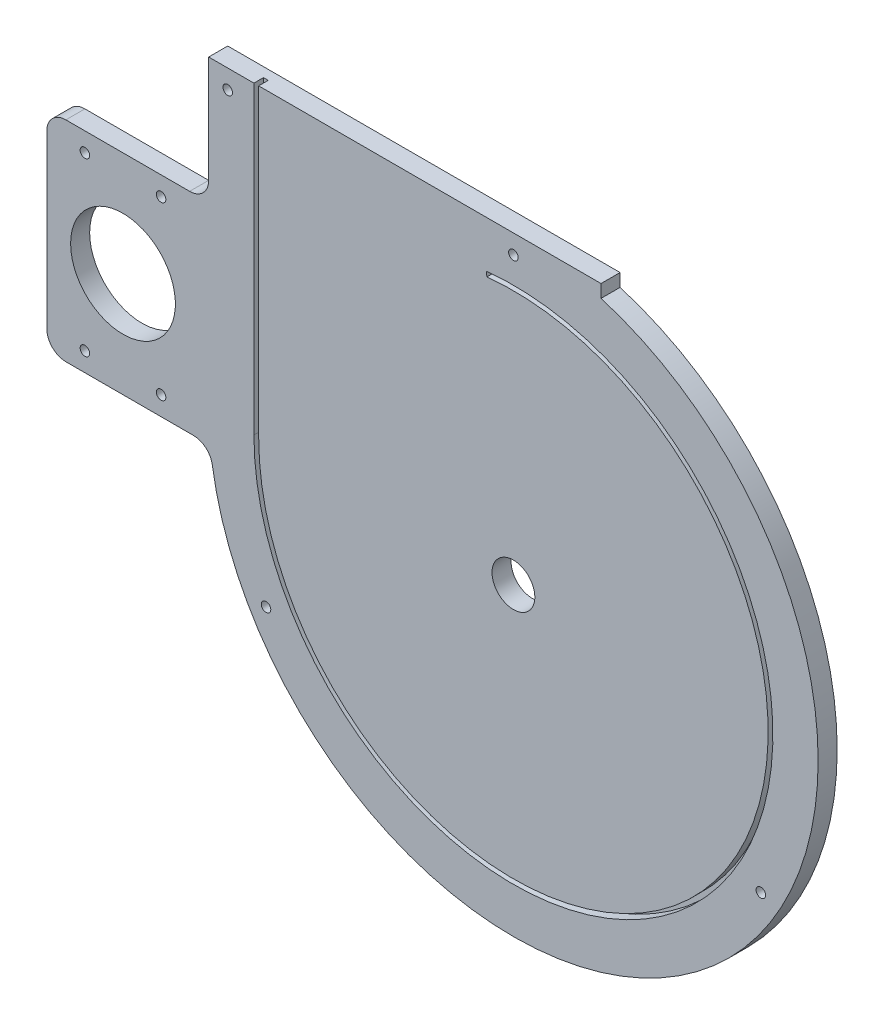
ISO-10303-21;
HEADER;
FILE_DESCRIPTION(('STEP AP214'),'2;1');
FILE_NAME('part.step','',(''),(''),'','','');
FILE_SCHEMA(('AUTOMOTIVE_DESIGN { 1 0 10303 214 1 1 1 1 }'));
ENDSEC;
DATA;
#1=APPLICATION_CONTEXT('core data for automotive mechanical design processes');
#2=APPLICATION_PROTOCOL_DEFINITION('international standard','automotive_design',2000,#1);
#3=PRODUCT_CONTEXT('',#1,'mechanical');
#4=PRODUCT('Part','Part','',(#3));
#5=PRODUCT_RELATED_PRODUCT_CATEGORY('part','',(#4));
#6=PRODUCT_DEFINITION_FORMATION('','',#4);
#7=PRODUCT_DEFINITION_CONTEXT('part definition',#1,'design');
#8=PRODUCT_DEFINITION('design','',#6,#7);
#9=PRODUCT_DEFINITION_SHAPE('','',#8);
#10=(LENGTH_UNIT() NAMED_UNIT(*) SI_UNIT(.MILLI.,.METRE.));
#11=(NAMED_UNIT(*) PLANE_ANGLE_UNIT() SI_UNIT($,.RADIAN.));
#12=(NAMED_UNIT(*) SI_UNIT($,.STERADIAN.) SOLID_ANGLE_UNIT());
#13=UNCERTAINTY_MEASURE_WITH_UNIT(LENGTH_MEASURE(1.E-05),#10,'distance_accuracy_value','');
#14=(GEOMETRIC_REPRESENTATION_CONTEXT(3) GLOBAL_UNCERTAINTY_ASSIGNED_CONTEXT((#13)) GLOBAL_UNIT_ASSIGNED_CONTEXT((#10,
#11,#12)) REPRESENTATION_CONTEXT('',''));
#15=CARTESIAN_POINT('',(0.,0.,0.));
#16=DIRECTION('',(0.,0.,1.));
#17=DIRECTION('',(1.,0.,0.));
#18=AXIS2_PLACEMENT_3D('',#15,#16,#17);
#19=CARTESIAN_POINT('',(0.,0.,12.7));
#20=DIRECTION('',(0.,0.,1.));
#21=DIRECTION('',(1.,0.,0.));
#22=AXIS2_PLACEMENT_3D('',#19,#20,#21);
#23=PLANE('',#22);
#24=DIRECTION('',(0.,1.,0.));
#25=VECTOR('',#24,1.);
#26=CARTESIAN_POINT('',(-311.15,119.275474201064,12.7));
#27=LINE('',#26,#25);
#28=CARTESIAN_POINT('',(-311.15,-7.72452579893591,12.7));
#29=VERTEX_POINT('',#28);
#30=CARTESIAN_POINT('',(-311.15,106.575474201064,12.7));
#31=VERTEX_POINT('',#30);
#32=EDGE_CURVE('E383',#29,#31,#27,.T.);
#33=ORIENTED_EDGE('',*,*,#32,.F.);
#34=CARTESIAN_POINT('',(-298.45,-7.72452579893591,12.7));
#35=DIRECTION('',(0.,0.,1.));
#36=DIRECTION('',(1.,0.,0.));
#37=AXIS2_PLACEMENT_3D('',#34,#35,#36);
#38=CIRCLE('',#37,12.7);
#39=CARTESIAN_POINT('',(-298.45,-20.4245257989359,12.7));
#40=VERTEX_POINT('',#39);
#41=EDGE_CURVE('E281',#29,#40,#38,.T.);
#42=ORIENTED_EDGE('',*,*,#41,.T.);
#43=DIRECTION('',(-1.,0.,0.));
#44=VECTOR('',#43,1.);
#45=CARTESIAN_POINT('',(-202.170914688262,-20.4245257989362,12.7));
#46=LINE('',#45,#44);
#47=CARTESIAN_POINT('',(-213.343797169253,-20.4245257989361,12.7));
#48=VERTEX_POINT('',#47);
#49=EDGE_CURVE('E298',#48,#40,#46,.T.);
#50=ORIENTED_EDGE('',*,*,#49,.F.);
#51=CARTESIAN_POINT('',(-213.343797169253,-33.1245257989362,12.7));
#52=DIRECTION('',(0.,0.,1.));
#53=DIRECTION('',(1.,0.,0.));
#54=AXIS2_PLACEMENT_3D('',#51,#52,#53);
#55=CIRCLE('',#54,12.7);
#56=CARTESIAN_POINT('',(-200.79416204165,-31.1760242813517,12.7));
#57=VERTEX_POINT('',#56);
#58=EDGE_CURVE('E292',#48,#57,#55,.F.);
#59=ORIENTED_EDGE('',*,*,#58,.T.);
#60=CARTESIAN_POINT('',(0.,0.,12.7));
#61=DIRECTION('',(0.,0.,1.));
#62=DIRECTION('',(1.,0.,0.));
#63=AXIS2_PLACEMENT_3D('',#60,#61,#62);
#64=CIRCLE('',#63,203.2);
#65=CARTESIAN_POINT('',(58.4327048944707,194.617211465779,12.7));
#66=VERTEX_POINT('',#65);
#67=EDGE_CURVE('E200',#57,#66,#64,.T.);
#68=ORIENTED_EDGE('',*,*,#67,.T.);
#69=DIRECTION('',(0.,1.,0.));
#70=VECTOR('',#69,1.);
#71=CARTESIAN_POINT('',(58.4327048944707,0.,12.7));
#72=LINE('',#71,#70);
#73=CARTESIAN_POINT('',(58.4327048944707,203.2,12.7));
#74=VERTEX_POINT('',#73);
#75=EDGE_CURVE('E180',#66,#74,#72,.T.);
#76=ORIENTED_EDGE('',*,*,#75,.T.);
#77=DIRECTION('',(-1.,0.,0.));
#78=VECTOR('',#77,1.);
#79=CARTESIAN_POINT('',(203.2,203.2,12.7));
#80=LINE('',#79,#78);
#81=CARTESIAN_POINT('',(-169.8625,203.2,12.7));
#82=VERTEX_POINT('',#81);
#83=EDGE_CURVE('E257',#74,#82,#80,.T.);
#84=ORIENTED_EDGE('',*,*,#83,.T.);
#85=DIRECTION('',(0.,1.,0.));
#86=VECTOR('',#85,1.);
#87=CARTESIAN_POINT('',(-169.8625,0.,12.7));
#88=LINE('',#87,#86);
#89=CARTESIAN_POINT('',(-169.8625,0.,12.7));
#90=VERTEX_POINT('',#89);
#91=EDGE_CURVE('E230',#90,#82,#88,.T.);
#92=ORIENTED_EDGE('',*,*,#91,.F.);
#93=CARTESIAN_POINT('',(0.,0.,12.7));
#94=DIRECTION('',(0.,0.,-1.));
#95=DIRECTION('',(-1.,0.,0.));
#96=AXIS2_PLACEMENT_3D('',#93,#94,#95);
#97=CIRCLE('',#96,169.8625);
#98=CARTESIAN_POINT('',(-17.696900372534,168.938120693509,12.7));
#99=VERTEX_POINT('',#98);
#100=EDGE_CURVE('E227',#99,#90,#97,.T.);
#101=ORIENTED_EDGE('',*,*,#100,.F.);
#102=DIRECTION('',(0.104183680167984,-0.994558073109185,0.));
#103=VECTOR('',#102,1.);
#104=CARTESIAN_POINT('',(-18.0276835570674,172.095842575631,12.7));
#105=LINE('',#104,#103);
#106=CARTESIAN_POINT('',(-18.0276835570674,172.095842575631,12.7));
#107=VERTEX_POINT('',#106);
#108=EDGE_CURVE('E224',#107,#99,#105,.T.);
#109=ORIENTED_EDGE('',*,*,#108,.F.);
#110=CARTESIAN_POINT('',(0.,0.,12.7));
#111=DIRECTION('',(0.,0.,1.));
#112=DIRECTION('',(-1.,0.,0.));
#113=AXIS2_PLACEMENT_3D('',#110,#111,#112);
#114=CIRCLE('',#113,173.0375);
#115=CARTESIAN_POINT('',(-173.0375,0.,12.7));
#116=VERTEX_POINT('',#115);
#117=EDGE_CURVE('E187',#116,#107,#114,.T.);
#118=ORIENTED_EDGE('',*,*,#117,.F.);
#119=DIRECTION('',(0.,-1.,0.));
#120=VECTOR('',#119,1.);
#121=CARTESIAN_POINT('',(-173.0375,0.,12.7));
#122=LINE('',#121,#120);
#123=CARTESIAN_POINT('',(-173.0375,203.2,12.7));
#124=VERTEX_POINT('',#123);
#125=EDGE_CURVE('E208',#124,#116,#122,.T.);
#126=ORIENTED_EDGE('',*,*,#125,.F.);
#127=CARTESIAN_POINT('',(-203.2,203.2,12.7));
#128=VERTEX_POINT('',#127);
#129=EDGE_CURVE('E256',#124,#128,#80,.T.);
#130=ORIENTED_EDGE('',*,*,#129,.T.);
#131=DIRECTION('',(0.,-1.,0.));
#132=VECTOR('',#131,1.);
#133=CARTESIAN_POINT('',(-203.2,-203.2,12.7));
#134=LINE('',#133,#132);
#135=CARTESIAN_POINT('',(-203.2,131.975474201064,12.7));
#136=VERTEX_POINT('',#135);
#137=EDGE_CURVE('E254',#128,#136,#134,.T.);
#138=ORIENTED_EDGE('',*,*,#137,.T.);
#139=CARTESIAN_POINT('',(-215.9,131.975474201064,12.7));
#140=DIRECTION('',(0.,0.,1.));
#141=DIRECTION('',(1.,0.,0.));
#142=AXIS2_PLACEMENT_3D('',#139,#140,#141);
#143=CIRCLE('',#142,12.7);
#144=CARTESIAN_POINT('',(-215.9,119.275474201064,12.7));
#145=VERTEX_POINT('',#144);
#146=EDGE_CURVE('E59',#136,#145,#143,.F.);
#147=ORIENTED_EDGE('',*,*,#146,.T.);
#148=DIRECTION('',(1.,0.,0.));
#149=VECTOR('',#148,1.);
#150=CARTESIAN_POINT('',(-202.170914688262,119.275474201064,12.7));
#151=LINE('',#150,#149);
#152=CARTESIAN_POINT('',(-298.45,119.275474201064,12.7));
#153=VERTEX_POINT('',#152);
#154=EDGE_CURVE('E317',#153,#145,#151,.T.);
#155=ORIENTED_EDGE('',*,*,#154,.F.);
#156=CARTESIAN_POINT('',(-298.45,106.575474201064,12.7));
#157=DIRECTION('',(0.,0.,1.));
#158=DIRECTION('',(1.,0.,0.));
#159=AXIS2_PLACEMENT_3D('',#156,#157,#158);
#160=CIRCLE('',#159,12.7);
#161=EDGE_CURVE('E279',#153,#31,#160,.T.);
#162=ORIENTED_EDGE('',*,*,#161,.T.);
#163=EDGE_LOOP('',(#33,#42,#50,#59,#68,#76,#84,#92,#101,#109,#118,#126,#130,#138,#147,#155,#162));
#164=FACE_BOUND('',#163,.T.);
#165=CARTESIAN_POINT('',(-164.977839420936,-95.2500000000001,12.7));
#166=DIRECTION('',(0.,0.,1.));
#167=DIRECTION('',(1.,0.,0.));
#168=AXIS2_PLACEMENT_3D('',#165,#166,#167);
#169=CIRCLE('',#168,3.175);
#170=CARTESIAN_POINT('',(-161.802839420935,-95.2500000000001,12.7));
#171=VERTEX_POINT('',#170);
#172=EDGE_CURVE('E337',#171,#171,#169,.T.);
#173=ORIENTED_EDGE('',*,*,#172,.F.);
#174=EDGE_LOOP('',(#173));
#175=FACE_BOUND('',#174,.T.);
#176=CARTESIAN_POINT('',(164.977839420936,-95.25,12.7));
#177=DIRECTION('',(0.,0.,1.));
#178=DIRECTION('',(1.,0.,0.));
#179=AXIS2_PLACEMENT_3D('',#176,#177,#178);
#180=CIRCLE('',#179,3.175);
#181=CARTESIAN_POINT('',(168.152839420936,-95.25,12.7));
#182=VERTEX_POINT('',#181);
#183=EDGE_CURVE('E334',#182,#182,#180,.T.);
#184=ORIENTED_EDGE('',*,*,#183,.F.);
#185=EDGE_LOOP('',(#184));
#186=FACE_BOUND('',#185,.T.);
#187=CARTESIAN_POINT('',(0.,190.5,12.7));
#188=DIRECTION('',(0.,0.,1.));
#189=DIRECTION('',(1.,0.,0.));
#190=AXIS2_PLACEMENT_3D('',#187,#188,#189);
#191=CIRCLE('',#190,3.175);
#192=CARTESIAN_POINT('',(3.175,190.5,12.7));
#193=VERTEX_POINT('',#192);
#194=EDGE_CURVE('E325',#193,#193,#191,.T.);
#195=ORIENTED_EDGE('',*,*,#194,.F.);
#196=EDGE_LOOP('',(#195));
#197=FACE_BOUND('',#196,.T.);
#198=CARTESIAN_POINT('',(-190.5,190.5,12.7));
#199=DIRECTION('',(0.,0.,1.));
#200=DIRECTION('',(1.,0.,0.));
#201=AXIS2_PLACEMENT_3D('',#198,#199,#200);
#202=CIRCLE('',#201,3.175);
#203=CARTESIAN_POINT('',(-187.325,190.5,12.7));
#204=VERTEX_POINT('',#203);
#205=EDGE_CURVE('E202',#204,#204,#202,.T.);
#206=ORIENTED_EDGE('',*,*,#205,.F.);
#207=EDGE_LOOP('',(#206));
#208=FACE_BOUND('',#207,.T.);
#209=CARTESIAN_POINT('',(0.,0.,12.7));
#210=DIRECTION('',(0.,0.,1.));
#211=DIRECTION('',(1.,0.,0.));
#212=AXIS2_PLACEMENT_3D('',#209,#210,#211);
#213=CIRCLE('',#212,14.2875);
#214=CARTESIAN_POINT('',(14.2875,0.,12.7));
#215=VERTEX_POINT('',#214);
#216=EDGE_CURVE('E248',#215,#215,#213,.T.);
#217=ORIENTED_EDGE('',*,*,#216,.F.);
#218=EDGE_LOOP('',(#217));
#219=FACE_BOUND('',#218,.T.);
#220=CARTESIAN_POINT('',(-234.95,-7.72452579893646,12.7));
#221=DIRECTION('',(0.,0.,-1.));
#222=DIRECTION('',(-1.,0.,0.));
#223=AXIS2_PLACEMENT_3D('',#220,#221,#222);
#224=CIRCLE('',#223,3.175);
#225=CARTESIAN_POINT('',(-238.125,-7.72452579893646,12.7));
#226=VERTEX_POINT('',#225);
#227=EDGE_CURVE('E356',#226,#226,#224,.T.);
#228=ORIENTED_EDGE('',*,*,#227,.T.);
#229=EDGE_LOOP('',(#228));
#230=FACE_BOUND('',#229,.T.);
#231=CARTESIAN_POINT('',(-285.75,-7.72452579893646,12.7));
#232=DIRECTION('',(0.,0.,-1.));
#233=DIRECTION('',(-1.,0.,0.));
#234=AXIS2_PLACEMENT_3D('',#231,#232,#233);
#235=CIRCLE('',#234,3.17499999999997);
#236=CARTESIAN_POINT('',(-288.925,-7.72452579893646,12.7));
#237=VERTEX_POINT('',#236);
#238=EDGE_CURVE('E360',#237,#237,#235,.T.);
#239=ORIENTED_EDGE('',*,*,#238,.T.);
#240=EDGE_LOOP('',(#239));
#241=FACE_BOUND('',#240,.T.);
#242=CARTESIAN_POINT('',(-285.75,106.575474201064,12.7));
#243=DIRECTION('',(0.,0.,-1.));
#244=DIRECTION('',(-1.,0.,0.));
#245=AXIS2_PLACEMENT_3D('',#242,#243,#244);
#246=CIRCLE('',#245,3.17499999999997);
#247=CARTESIAN_POINT('',(-288.925,106.575474201064,12.7));
#248=VERTEX_POINT('',#247);
#249=EDGE_CURVE('E364',#248,#248,#246,.T.);
#250=ORIENTED_EDGE('',*,*,#249,.T.);
#251=EDGE_LOOP('',(#250));
#252=FACE_BOUND('',#251,.T.);
#253=CARTESIAN_POINT('',(-260.35,49.4254742010641,12.7));
#254=DIRECTION('',(0.,0.,-1.));
#255=DIRECTION('',(-1.,0.,0.));
#256=AXIS2_PLACEMENT_3D('',#253,#254,#255);
#257=CIRCLE('',#256,34.925);
#258=CARTESIAN_POINT('',(-295.275,49.4254742010641,12.7));
#259=VERTEX_POINT('',#258);
#260=EDGE_CURVE('E368',#259,#259,#257,.T.);
#261=ORIENTED_EDGE('',*,*,#260,.T.);
#262=EDGE_LOOP('',(#261));
#263=FACE_BOUND('',#262,.T.);
#264=CARTESIAN_POINT('',(-234.95,106.575474201064,12.7));
#265=DIRECTION('',(0.,0.,-1.));
#266=DIRECTION('',(-1.,0.,0.));
#267=AXIS2_PLACEMENT_3D('',#264,#265,#266);
#268=CIRCLE('',#267,3.17499999999997);
#269=CARTESIAN_POINT('',(-238.125,106.575474201064,12.7));
#270=VERTEX_POINT('',#269);
#271=EDGE_CURVE('E308',#270,#270,#268,.T.);
#272=ORIENTED_EDGE('',*,*,#271,.T.);
#273=EDGE_LOOP('',(#272));
#274=FACE_BOUND('',#273,.T.);
#275=ADVANCED_FACE('F51',(#164,#175,#186,#197,#208,#219,#230,#241,#252,#263,#274),#23,.T.);
#276=CARTESIAN_POINT('',(0.,0.,0.));
#277=DIRECTION('',(0.,0.,1.));
#278=DIRECTION('',(1.,0.,0.));
#279=AXIS2_PLACEMENT_3D('',#276,#277,#278);
#280=PLANE('',#279);
#281=CARTESIAN_POINT('',(-164.977839420936,-95.2500000000001,0.));
#282=DIRECTION('',(0.,0.,1.));
#283=DIRECTION('',(1.,0.,0.));
#284=AXIS2_PLACEMENT_3D('',#281,#282,#283);
#285=CIRCLE('',#284,3.175);
#286=CARTESIAN_POINT('',(-161.802839420935,-95.2500000000001,0.));
#287=VERTEX_POINT('',#286);
#288=EDGE_CURVE('E322',#287,#287,#285,.T.);
#289=ORIENTED_EDGE('',*,*,#288,.T.);
#290=EDGE_LOOP('',(#289));
#291=FACE_BOUND('',#290,.T.);
#292=CARTESIAN_POINT('',(164.977839420936,-95.25,0.));
#293=DIRECTION('',(0.,0.,1.));
#294=DIRECTION('',(1.,0.,0.));
#295=AXIS2_PLACEMENT_3D('',#292,#293,#294);
#296=CIRCLE('',#295,3.175);
#297=CARTESIAN_POINT('',(168.152839420936,-95.25,0.));
#298=VERTEX_POINT('',#297);
#299=EDGE_CURVE('E326',#298,#298,#296,.T.);
#300=ORIENTED_EDGE('',*,*,#299,.T.);
#301=EDGE_LOOP('',(#300));
#302=FACE_BOUND('',#301,.T.);
#303=CARTESIAN_POINT('',(0.,190.5,0.));
#304=DIRECTION('',(0.,0.,1.));
#305=DIRECTION('',(1.,0.,0.));
#306=AXIS2_PLACEMENT_3D('',#303,#304,#305);
#307=CIRCLE('',#306,3.175);
#308=CARTESIAN_POINT('',(3.175,190.5,0.));
#309=VERTEX_POINT('',#308);
#310=EDGE_CURVE('E329',#309,#309,#307,.T.);
#311=ORIENTED_EDGE('',*,*,#310,.T.);
#312=EDGE_LOOP('',(#311));
#313=FACE_BOUND('',#312,.T.);
#314=CARTESIAN_POINT('',(-190.5,190.5,0.));
#315=DIRECTION('',(0.,0.,1.));
#316=DIRECTION('',(1.,0.,0.));
#317=AXIS2_PLACEMENT_3D('',#314,#315,#316);
#318=CIRCLE('',#317,3.175);
#319=CARTESIAN_POINT('',(-187.325,190.5,0.));
#320=VERTEX_POINT('',#319);
#321=EDGE_CURVE('E340',#320,#320,#318,.T.);
#322=ORIENTED_EDGE('',*,*,#321,.T.);
#323=EDGE_LOOP('',(#322));
#324=FACE_BOUND('',#323,.T.);
#325=CARTESIAN_POINT('',(0.,0.,0.));
#326=DIRECTION('',(0.,0.,1.));
#327=DIRECTION('',(1.,0.,0.));
#328=AXIS2_PLACEMENT_3D('',#325,#326,#327);
#329=CIRCLE('',#328,14.2875);
#330=CARTESIAN_POINT('',(14.2875,0.,0.));
#331=VERTEX_POINT('',#330);
#332=EDGE_CURVE('E237',#331,#331,#329,.T.);
#333=ORIENTED_EDGE('',*,*,#332,.T.);
#334=EDGE_LOOP('',(#333));
#335=FACE_BOUND('',#334,.T.);
#336=DIRECTION('',(-1.,0.,0.));
#337=VECTOR('',#336,1.);
#338=CARTESIAN_POINT('',(-202.170914688262,-20.4245257989362,0.));
#339=LINE('',#338,#337);
#340=CARTESIAN_POINT('',(-213.343797169253,-20.4245257989361,0.));
#341=VERTEX_POINT('',#340);
#342=CARTESIAN_POINT('',(-298.45,-20.4245257989359,0.));
#343=VERTEX_POINT('',#342);
#344=EDGE_CURVE('E303',#341,#343,#339,.T.);
#345=ORIENTED_EDGE('',*,*,#344,.T.);
#346=CARTESIAN_POINT('',(-298.45,-7.72452579893591,0.));
#347=DIRECTION('',(0.,0.,1.));
#348=DIRECTION('',(1.,0.,0.));
#349=AXIS2_PLACEMENT_3D('',#346,#347,#348);
#350=CIRCLE('',#349,12.7);
#351=CARTESIAN_POINT('',(-311.15,-7.72452579893591,0.));
#352=VERTEX_POINT('',#351);
#353=EDGE_CURVE('E272',#343,#352,#350,.F.);
#354=ORIENTED_EDGE('',*,*,#353,.T.);
#355=DIRECTION('',(0.,1.,0.));
#356=VECTOR('',#355,1.);
#357=CARTESIAN_POINT('',(-311.15,119.275474201064,0.));
#358=LINE('',#357,#356);
#359=CARTESIAN_POINT('',(-311.15,106.575474201064,0.));
#360=VERTEX_POINT('',#359);
#361=EDGE_CURVE('E307',#352,#360,#358,.T.);
#362=ORIENTED_EDGE('',*,*,#361,.T.);
#363=CARTESIAN_POINT('',(-298.45,106.575474201064,0.));
#364=DIRECTION('',(0.,0.,1.));
#365=DIRECTION('',(1.,0.,0.));
#366=AXIS2_PLACEMENT_3D('',#363,#364,#365);
#367=CIRCLE('',#366,12.7);
#368=CARTESIAN_POINT('',(-298.45,119.275474201064,0.));
#369=VERTEX_POINT('',#368);
#370=EDGE_CURVE('E270',#360,#369,#367,.F.);
#371=ORIENTED_EDGE('',*,*,#370,.T.);
#372=DIRECTION('',(1.,0.,0.));
#373=VECTOR('',#372,1.);
#374=CARTESIAN_POINT('',(-202.170914688262,119.275474201064,0.));
#375=LINE('',#374,#373);
#376=CARTESIAN_POINT('',(-215.9,119.275474201064,0.));
#377=VERTEX_POINT('',#376);
#378=EDGE_CURVE('E311',#369,#377,#375,.T.);
#379=ORIENTED_EDGE('',*,*,#378,.T.);
#380=CARTESIAN_POINT('',(-215.9,131.975474201064,0.));
#381=DIRECTION('',(0.,0.,1.));
#382=DIRECTION('',(1.,0.,0.));
#383=AXIS2_PLACEMENT_3D('',#380,#381,#382);
#384=CIRCLE('',#383,12.7);
#385=CARTESIAN_POINT('',(-203.2,131.975474201064,0.));
#386=VERTEX_POINT('',#385);
#387=EDGE_CURVE('E12',#377,#386,#384,.T.);
#388=ORIENTED_EDGE('',*,*,#387,.T.);
#389=DIRECTION('',(0.,-1.,0.));
#390=VECTOR('',#389,1.);
#391=CARTESIAN_POINT('',(-203.2,-203.2,0.));
#392=LINE('',#391,#390);
#393=CARTESIAN_POINT('',(-203.2,203.2,0.));
#394=VERTEX_POINT('',#393);
#395=EDGE_CURVE('E251',#394,#386,#392,.T.);
#396=ORIENTED_EDGE('',*,*,#395,.F.);
#397=DIRECTION('',(-1.,0.,0.));
#398=VECTOR('',#397,1.);
#399=CARTESIAN_POINT('',(203.2,203.2,0.));
#400=LINE('',#399,#398);
#401=CARTESIAN_POINT('',(58.4327048944707,203.2,0.));
#402=VERTEX_POINT('',#401);
#403=EDGE_CURVE('E195',#402,#394,#400,.T.);
#404=ORIENTED_EDGE('',*,*,#403,.F.);
#405=DIRECTION('',(0.,1.,0.));
#406=VECTOR('',#405,1.);
#407=CARTESIAN_POINT('',(58.4327048944707,0.,0.));
#408=LINE('',#407,#406);
#409=CARTESIAN_POINT('',(58.4327048944707,194.617211465779,0.));
#410=VERTEX_POINT('',#409);
#411=EDGE_CURVE('E179',#410,#402,#408,.T.);
#412=ORIENTED_EDGE('',*,*,#411,.F.);
#413=CARTESIAN_POINT('',(0.,0.,0.));
#414=DIRECTION('',(0.,0.,1.));
#415=DIRECTION('',(1.,0.,0.));
#416=AXIS2_PLACEMENT_3D('',#413,#414,#415);
#417=CIRCLE('',#416,203.2);
#418=CARTESIAN_POINT('',(-200.79416204165,-31.1760242813517,0.));
#419=VERTEX_POINT('',#418);
#420=EDGE_CURVE('E170',#419,#410,#417,.T.);
#421=ORIENTED_EDGE('',*,*,#420,.F.);
#422=CARTESIAN_POINT('',(-213.343797169253,-33.1245257989362,0.));
#423=DIRECTION('',(0.,0.,1.));
#424=DIRECTION('',(1.,0.,0.));
#425=AXIS2_PLACEMENT_3D('',#422,#423,#424);
#426=CIRCLE('',#425,12.7);
#427=EDGE_CURVE('E290',#419,#341,#426,.T.);
#428=ORIENTED_EDGE('',*,*,#427,.T.);
#429=EDGE_LOOP('',(#345,#354,#362,#371,#379,#388,#396,#404,#412,#421,#428));
#430=FACE_BOUND('',#429,.T.);
#431=CARTESIAN_POINT('',(-234.95,106.575474201064,0.));
#432=DIRECTION('',(0.,0.,-1.));
#433=DIRECTION('',(-1.,0.,0.));
#434=AXIS2_PLACEMENT_3D('',#431,#432,#433);
#435=CIRCLE('',#434,3.17499999999997);
#436=CARTESIAN_POINT('',(-238.125,106.575474201064,0.));
#437=VERTEX_POINT('',#436);
#438=EDGE_CURVE('E314',#437,#437,#435,.T.);
#439=ORIENTED_EDGE('',*,*,#438,.F.);
#440=EDGE_LOOP('',(#439));
#441=FACE_BOUND('',#440,.T.);
#442=CARTESIAN_POINT('',(-260.35,49.4254742010641,0.));
#443=DIRECTION('',(0.,0.,-1.));
#444=DIRECTION('',(-1.,0.,0.));
#445=AXIS2_PLACEMENT_3D('',#442,#443,#444);
#446=CIRCLE('',#445,34.925);
#447=CARTESIAN_POINT('',(-295.275,49.4254742010641,0.));
#448=VERTEX_POINT('',#447);
#449=EDGE_CURVE('E379',#448,#448,#446,.T.);
#450=ORIENTED_EDGE('',*,*,#449,.F.);
#451=EDGE_LOOP('',(#450));
#452=FACE_BOUND('',#451,.T.);
#453=CARTESIAN_POINT('',(-285.75,106.575474201064,0.));
#454=DIRECTION('',(0.,0.,-1.));
#455=DIRECTION('',(-1.,0.,0.));
#456=AXIS2_PLACEMENT_3D('',#453,#454,#455);
#457=CIRCLE('',#456,3.17499999999997);
#458=CARTESIAN_POINT('',(-288.925,106.575474201064,0.));
#459=VERTEX_POINT('',#458);
#460=EDGE_CURVE('E707',#459,#459,#457,.T.);
#461=ORIENTED_EDGE('',*,*,#460,.F.);
#462=EDGE_LOOP('',(#461));
#463=FACE_BOUND('',#462,.T.);
#464=CARTESIAN_POINT('',(-285.75,-7.72452579893646,0.));
#465=DIRECTION('',(0.,0.,-1.));
#466=DIRECTION('',(-1.,0.,0.));
#467=AXIS2_PLACEMENT_3D('',#464,#465,#466);
#468=CIRCLE('',#467,3.17499999999997);
#469=CARTESIAN_POINT('',(-288.925,-7.72452579893646,0.));
#470=VERTEX_POINT('',#469);
#471=EDGE_CURVE('E712',#470,#470,#468,.T.);
#472=ORIENTED_EDGE('',*,*,#471,.F.);
#473=EDGE_LOOP('',(#472));
#474=FACE_BOUND('',#473,.T.);
#475=CARTESIAN_POINT('',(-234.95,-7.72452579893646,0.));
#476=DIRECTION('',(0.,0.,-1.));
#477=DIRECTION('',(-1.,0.,0.));
#478=AXIS2_PLACEMENT_3D('',#475,#476,#477);
#479=CIRCLE('',#478,3.175);
#480=CARTESIAN_POINT('',(-238.125,-7.72452579893646,0.));
#481=VERTEX_POINT('',#480);
#482=EDGE_CURVE('E716',#481,#481,#479,.T.);
#483=ORIENTED_EDGE('',*,*,#482,.F.);
#484=EDGE_LOOP('',(#483));
#485=FACE_BOUND('',#484,.T.);
#486=ADVANCED_FACE('F192',(#291,#302,#313,#324,#335,#430,#441,#452,#463,#474,#485),#280,.F.);
#487=CARTESIAN_POINT('',(203.2,203.2,12.7));
#488=DIRECTION('',(0.,-1.,0.));
#489=DIRECTION('',(1.,0.,0.));
#490=AXIS2_PLACEMENT_3D('',#487,#488,#489);
#491=PLANE('',#490);
#492=DIRECTION('',(0.,0.,1.));
#493=VECTOR('',#492,1.);
#494=CARTESIAN_POINT('',(58.4327048944707,203.2,0.));
#495=LINE('',#494,#493);
#496=EDGE_CURVE('E188',#402,#74,#495,.T.);
#497=ORIENTED_EDGE('',*,*,#496,.F.);
#498=ORIENTED_EDGE('',*,*,#403,.T.);
#499=DIRECTION('',(0.,0.,-1.));
#500=VECTOR('',#499,1.);
#501=CARTESIAN_POINT('',(-203.2,203.2,12.7));
#502=LINE('',#501,#500);
#503=EDGE_CURVE('E259',#128,#394,#502,.T.);
#504=ORIENTED_EDGE('',*,*,#503,.F.);
#505=ORIENTED_EDGE('',*,*,#129,.F.);
#506=DIRECTION('',(0.,0.,1.));
#507=VECTOR('',#506,1.);
#508=CARTESIAN_POINT('',(-173.0375,203.2,6.35));
#509=LINE('',#508,#507);
#510=CARTESIAN_POINT('',(-173.0375,203.2,6.35));
#511=VERTEX_POINT('',#510);
#512=EDGE_CURVE('E238',#511,#124,#509,.T.);
#513=ORIENTED_EDGE('',*,*,#512,.F.);
#514=DIRECTION('',(-1.,0.,0.));
#515=VECTOR('',#514,1.);
#516=CARTESIAN_POINT('',(-169.8625,203.2,6.35));
#517=LINE('',#516,#515);
#518=CARTESIAN_POINT('',(-169.8625,203.2,6.35));
#519=VERTEX_POINT('',#518);
#520=EDGE_CURVE('E216',#519,#511,#517,.T.);
#521=ORIENTED_EDGE('',*,*,#520,.F.);
#522=DIRECTION('',(0.,0.,1.));
#523=VECTOR('',#522,1.);
#524=CARTESIAN_POINT('',(-169.8625,203.2,6.35));
#525=LINE('',#524,#523);
#526=EDGE_CURVE('E240',#519,#82,#525,.T.);
#527=ORIENTED_EDGE('',*,*,#526,.T.);
#528=ORIENTED_EDGE('',*,*,#83,.F.);
#529=EDGE_LOOP('',(#497,#498,#504,#505,#513,#521,#527,#528));
#530=FACE_BOUND('',#529,.T.);
#531=ADVANCED_FACE('F399',(#530),#491,.F.);
#532=CARTESIAN_POINT('',(-203.2,-203.2,12.7));
#533=DIRECTION('',(1.,0.,0.));
#534=DIRECTION('',(0.,0.,-1.));
#535=AXIS2_PLACEMENT_3D('',#532,#533,#534);
#536=PLANE('',#535);
#537=ORIENTED_EDGE('',*,*,#395,.T.);
#538=DIRECTION('',(0.,0.,1.));
#539=VECTOR('',#538,1.);
#540=CARTESIAN_POINT('',(-203.2,131.975474201064,12.7));
#541=LINE('',#540,#539);
#542=EDGE_CURVE('E287',#386,#136,#541,.T.);
#543=ORIENTED_EDGE('',*,*,#542,.T.);
#544=ORIENTED_EDGE('',*,*,#137,.F.);
#545=ORIENTED_EDGE('',*,*,#503,.T.);
#546=EDGE_LOOP('',(#537,#543,#544,#545));
#547=FACE_BOUND('',#546,.T.);
#548=ADVANCED_FACE('F394',(#547),#536,.F.);
#549=CARTESIAN_POINT('',(0.,0.,12.7));
#550=DIRECTION('',(0.,0.,-1.));
#551=DIRECTION('',(-1.,0.,0.));
#552=AXIS2_PLACEMENT_3D('',#549,#550,#551);
#553=CYLINDRICAL_SURFACE('',#552,14.2875);
#554=ORIENTED_EDGE('',*,*,#216,.T.);
#555=EDGE_LOOP('',(#554));
#556=FACE_BOUND('',#555,.T.);
#557=ORIENTED_EDGE('',*,*,#332,.F.);
#558=EDGE_LOOP('',(#557));
#559=FACE_BOUND('',#558,.T.);
#560=ADVANCED_FACE('F438',(#556,#559),#553,.F.);
#561=CARTESIAN_POINT('',(0.,0.,6.35));
#562=DIRECTION('',(0.,0.,1.));
#563=DIRECTION('',(1.,0.,0.));
#564=AXIS2_PLACEMENT_3D('',#561,#562,#563);
#565=CYLINDRICAL_SURFACE('',#564,173.0375);
#566=ORIENTED_EDGE('',*,*,#117,.T.);
#567=DIRECTION('',(0.,0.,1.));
#568=VECTOR('',#567,1.);
#569=CARTESIAN_POINT('',(-18.0276835570674,172.095842575631,6.35));
#570=LINE('',#569,#568);
#571=CARTESIAN_POINT('',(-18.0276835570674,172.095842575631,6.35));
#572=VERTEX_POINT('',#571);
#573=EDGE_CURVE('E221',#572,#107,#570,.T.);
#574=ORIENTED_EDGE('',*,*,#573,.F.);
#575=CARTESIAN_POINT('',(0.,0.,6.35));
#576=DIRECTION('',(0.,0.,1.));
#577=DIRECTION('',(-1.,0.,0.));
#578=AXIS2_PLACEMENT_3D('',#575,#576,#577);
#579=CIRCLE('',#578,173.0375);
#580=CARTESIAN_POINT('',(-173.0375,0.,6.35));
#581=VERTEX_POINT('',#580);
#582=EDGE_CURVE('E204',#581,#572,#579,.T.);
#583=ORIENTED_EDGE('',*,*,#582,.F.);
#584=DIRECTION('',(0.,0.,1.));
#585=VECTOR('',#584,1.);
#586=CARTESIAN_POINT('',(-173.0375,0.,6.35));
#587=LINE('',#586,#585);
#588=EDGE_CURVE('E235',#581,#116,#587,.T.);
#589=ORIENTED_EDGE('',*,*,#588,.T.);
#590=EDGE_LOOP('',(#566,#574,#583,#589));
#591=FACE_BOUND('',#590,.T.);
#592=ADVANCED_FACE('F418',(#591),#565,.F.);
#593=CARTESIAN_POINT('',(-173.0375,0.,6.35));
#594=DIRECTION('',(-1.,0.,0.));
#595=DIRECTION('',(0.,-1.,0.));
#596=AXIS2_PLACEMENT_3D('',#593,#594,#595);
#597=PLANE('',#596);
#598=ORIENTED_EDGE('',*,*,#125,.T.);
#599=ORIENTED_EDGE('',*,*,#588,.F.);
#600=DIRECTION('',(0.,-1.,0.));
#601=VECTOR('',#600,1.);
#602=CARTESIAN_POINT('',(-173.0375,0.,6.35));
#603=LINE('',#602,#601);
#604=EDGE_CURVE('E218',#511,#581,#603,.T.);
#605=ORIENTED_EDGE('',*,*,#604,.F.);
#606=ORIENTED_EDGE('',*,*,#512,.T.);
#607=EDGE_LOOP('',(#598,#599,#605,#606));
#608=FACE_BOUND('',#607,.T.);
#609=ADVANCED_FACE('F413',(#608),#597,.F.);
#610=CARTESIAN_POINT('',(-169.8625,0.,6.35));
#611=DIRECTION('',(1.,0.,0.));
#612=DIRECTION('',(0.,1.,0.));
#613=AXIS2_PLACEMENT_3D('',#610,#611,#612);
#614=PLANE('',#613);
#615=ORIENTED_EDGE('',*,*,#91,.T.);
#616=ORIENTED_EDGE('',*,*,#526,.F.);
#617=DIRECTION('',(0.,1.,0.));
#618=VECTOR('',#617,1.);
#619=CARTESIAN_POINT('',(-169.8625,0.,6.35));
#620=LINE('',#619,#618);
#621=CARTESIAN_POINT('',(-169.8625,0.,6.35));
#622=VERTEX_POINT('',#621);
#623=EDGE_CURVE('E214',#622,#519,#620,.T.);
#624=ORIENTED_EDGE('',*,*,#623,.F.);
#625=DIRECTION('',(0.,0.,1.));
#626=VECTOR('',#625,1.);
#627=CARTESIAN_POINT('',(-169.8625,0.,6.35));
#628=LINE('',#627,#626);
#629=EDGE_CURVE('E243',#622,#90,#628,.T.);
#630=ORIENTED_EDGE('',*,*,#629,.T.);
#631=EDGE_LOOP('',(#615,#616,#624,#630));
#632=FACE_BOUND('',#631,.T.);
#633=ADVANCED_FACE('F406',(#632),#614,.F.);
#634=CARTESIAN_POINT('',(0.,0.,6.35));
#635=DIRECTION('',(0.,0.,1.));
#636=DIRECTION('',(1.,0.,0.));
#637=AXIS2_PLACEMENT_3D('',#634,#635,#636);
#638=CYLINDRICAL_SURFACE('',#637,169.8625);
#639=ORIENTED_EDGE('',*,*,#100,.T.);
#640=ORIENTED_EDGE('',*,*,#629,.F.);
#641=CARTESIAN_POINT('',(0.,0.,6.35));
#642=DIRECTION('',(0.,0.,-1.));
#643=DIRECTION('',(-1.,0.,0.));
#644=AXIS2_PLACEMENT_3D('',#641,#642,#643);
#645=CIRCLE('',#644,169.8625);
#646=CARTESIAN_POINT('',(-17.696900372534,168.938120693509,6.35));
#647=VERTEX_POINT('',#646);
#648=EDGE_CURVE('E211',#647,#622,#645,.T.);
#649=ORIENTED_EDGE('',*,*,#648,.F.);
#650=DIRECTION('',(0.,0.,1.));
#651=VECTOR('',#650,1.);
#652=CARTESIAN_POINT('',(-17.696900372534,168.938120693509,6.35));
#653=LINE('',#652,#651);
#654=EDGE_CURVE('E245',#647,#99,#653,.T.);
#655=ORIENTED_EDGE('',*,*,#654,.T.);
#656=EDGE_LOOP('',(#639,#640,#649,#655));
#657=FACE_BOUND('',#656,.T.);
#658=ADVANCED_FACE('F425',(#657),#638,.T.);
#659=CARTESIAN_POINT('',(-18.0276835570674,172.095842575631,6.35));
#660=DIRECTION('',(-0.994558073109185,-0.104183680167984,0.));
#661=DIRECTION('',(0.104183680167984,-0.994558073109185,0.));
#662=AXIS2_PLACEMENT_3D('',#659,#660,#661);
#663=PLANE('',#662);
#664=ORIENTED_EDGE('',*,*,#108,.T.);
#665=ORIENTED_EDGE('',*,*,#654,.F.);
#666=DIRECTION('',(0.104183680167984,-0.994558073109185,0.));
#667=VECTOR('',#666,1.);
#668=CARTESIAN_POINT('',(-18.0276835570674,172.095842575631,6.35));
#669=LINE('',#668,#667);
#670=EDGE_CURVE('E207',#572,#647,#669,.T.);
#671=ORIENTED_EDGE('',*,*,#670,.F.);
#672=ORIENTED_EDGE('',*,*,#573,.T.);
#673=EDGE_LOOP('',(#664,#665,#671,#672));
#674=FACE_BOUND('',#673,.T.);
#675=ADVANCED_FACE('F422',(#674),#663,.F.);
#676=CARTESIAN_POINT('',(0.,0.,6.35));
#677=DIRECTION('',(0.,0.,-1.));
#678=DIRECTION('',(-1.,0.,0.));
#679=AXIS2_PLACEMENT_3D('',#676,#677,#678);
#680=PLANE('',#679);
#681=ORIENTED_EDGE('',*,*,#582,.T.);
#682=ORIENTED_EDGE('',*,*,#670,.T.);
#683=ORIENTED_EDGE('',*,*,#648,.T.);
#684=ORIENTED_EDGE('',*,*,#623,.T.);
#685=ORIENTED_EDGE('',*,*,#520,.T.);
#686=ORIENTED_EDGE('',*,*,#604,.T.);
#687=EDGE_LOOP('',(#681,#682,#683,#684,#685,#686));
#688=FACE_BOUND('',#687,.T.);
#689=ADVANCED_FACE('F411',(#688),#680,.F.);
#690=CARTESIAN_POINT('',(0.,0.,0.));
#691=DIRECTION('',(0.,0.,1.));
#692=DIRECTION('',(1.,0.,0.));
#693=AXIS2_PLACEMENT_3D('',#690,#691,#692);
#694=CYLINDRICAL_SURFACE('',#693,203.2);
#695=ORIENTED_EDGE('',*,*,#67,.F.);
#696=DIRECTION('',(0.,0.,1.));
#697=VECTOR('',#696,1.);
#698=CARTESIAN_POINT('',(-200.79416204165,-31.1760242813517,0.));
#699=LINE('',#698,#697);
#700=EDGE_CURVE('E176',#57,#419,#699,.F.);
#701=ORIENTED_EDGE('',*,*,#700,.T.);
#702=ORIENTED_EDGE('',*,*,#420,.T.);
#703=DIRECTION('',(0.,0.,1.));
#704=VECTOR('',#703,1.);
#705=CARTESIAN_POINT('',(58.4327048944707,194.617211465779,0.));
#706=LINE('',#705,#704);
#707=EDGE_CURVE('E174',#410,#66,#706,.T.);
#708=ORIENTED_EDGE('',*,*,#707,.T.);
#709=EDGE_LOOP('',(#695,#701,#702,#708));
#710=FACE_BOUND('',#709,.T.);
#711=ADVANCED_FACE('F173',(#710),#694,.T.);
#712=CARTESIAN_POINT('',(58.4327048944707,0.,0.));
#713=DIRECTION('',(1.,0.,0.));
#714=DIRECTION('',(0.,0.,-1.));
#715=AXIS2_PLACEMENT_3D('',#712,#713,#714);
#716=PLANE('',#715);
#717=ORIENTED_EDGE('',*,*,#75,.F.);
#718=ORIENTED_EDGE('',*,*,#707,.F.);
#719=ORIENTED_EDGE('',*,*,#411,.T.);
#720=ORIENTED_EDGE('',*,*,#496,.T.);
#721=EDGE_LOOP('',(#717,#718,#719,#720));
#722=FACE_BOUND('',#721,.T.);
#723=ADVANCED_FACE('F184',(#722),#716,.T.);
#724=CARTESIAN_POINT('',(-190.5,190.5,0.));
#725=DIRECTION('',(0.,0.,1.));
#726=DIRECTION('',(1.,0.,0.));
#727=AXIS2_PLACEMENT_3D('',#724,#725,#726);
#728=CYLINDRICAL_SURFACE('',#727,3.175);
#729=ORIENTED_EDGE('',*,*,#205,.T.);
#730=EDGE_LOOP('',(#729));
#731=FACE_BOUND('',#730,.T.);
#732=ORIENTED_EDGE('',*,*,#321,.F.);
#733=EDGE_LOOP('',(#732));
#734=FACE_BOUND('',#733,.T.);
#735=ADVANCED_FACE('F345',(#731,#734),#728,.F.);
#736=CARTESIAN_POINT('',(0.,190.5,0.));
#737=DIRECTION('',(0.,0.,1.));
#738=DIRECTION('',(1.,0.,0.));
#739=AXIS2_PLACEMENT_3D('',#736,#737,#738);
#740=CYLINDRICAL_SURFACE('',#739,3.175);
#741=ORIENTED_EDGE('',*,*,#194,.T.);
#742=EDGE_LOOP('',(#741));
#743=FACE_BOUND('',#742,.T.);
#744=ORIENTED_EDGE('',*,*,#310,.F.);
#745=EDGE_LOOP('',(#744));
#746=FACE_BOUND('',#745,.T.);
#747=ADVANCED_FACE('F601',(#743,#746),#740,.F.);
#748=CARTESIAN_POINT('',(164.977839420936,-95.25,0.));
#749=DIRECTION('',(0.,0.,1.));
#750=DIRECTION('',(1.,0.,0.));
#751=AXIS2_PLACEMENT_3D('',#748,#749,#750);
#752=CYLINDRICAL_SURFACE('',#751,3.175);
#753=ORIENTED_EDGE('',*,*,#183,.T.);
#754=EDGE_LOOP('',(#753));
#755=FACE_BOUND('',#754,.T.);
#756=ORIENTED_EDGE('',*,*,#299,.F.);
#757=EDGE_LOOP('',(#756));
#758=FACE_BOUND('',#757,.T.);
#759=ADVANCED_FACE('F591',(#755,#758),#752,.F.);
#760=CARTESIAN_POINT('',(-164.977839420936,-95.2500000000001,0.));
#761=DIRECTION('',(0.,0.,1.));
#762=DIRECTION('',(1.,0.,0.));
#763=AXIS2_PLACEMENT_3D('',#760,#761,#762);
#764=CYLINDRICAL_SURFACE('',#763,3.175);
#765=ORIENTED_EDGE('',*,*,#172,.T.);
#766=EDGE_LOOP('',(#765));
#767=FACE_BOUND('',#766,.T.);
#768=ORIENTED_EDGE('',*,*,#288,.F.);
#769=EDGE_LOOP('',(#768));
#770=FACE_BOUND('',#769,.T.);
#771=ADVANCED_FACE('F508',(#767,#770),#764,.F.);
#772=CARTESIAN_POINT('',(-202.170914688262,119.275474201064,12.7));
#773=DIRECTION('',(0.,1.,0.));
#774=DIRECTION('',(-1.,0.,0.));
#775=AXIS2_PLACEMENT_3D('',#772,#773,#774);
#776=PLANE('',#775);
#777=ORIENTED_EDGE('',*,*,#378,.F.);
#778=DIRECTION('',(0.,0.,-1.));
#779=VECTOR('',#778,1.);
#780=CARTESIAN_POINT('',(-298.45,119.275474201064,12.7));
#781=LINE('',#780,#779);
#782=EDGE_CURVE('E72',#369,#153,#781,.F.);
#783=ORIENTED_EDGE('',*,*,#782,.T.);
#784=ORIENTED_EDGE('',*,*,#154,.T.);
#785=DIRECTION('',(0.,0.,1.));
#786=VECTOR('',#785,1.);
#787=CARTESIAN_POINT('',(-215.9,119.275474201064,12.7));
#788=LINE('',#787,#786);
#789=EDGE_CURVE('E283',#145,#377,#788,.F.);
#790=ORIENTED_EDGE('',*,*,#789,.T.);
#791=EDGE_LOOP('',(#777,#783,#784,#790));
#792=FACE_BOUND('',#791,.T.);
#793=ADVANCED_FACE('F388',(#792),#776,.T.);
#794=CARTESIAN_POINT('',(-311.15,119.275474201064,12.7));
#795=DIRECTION('',(-1.,0.,0.));
#796=DIRECTION('',(0.,-1.,0.));
#797=AXIS2_PLACEMENT_3D('',#794,#795,#796);
#798=PLANE('',#797);
#799=ORIENTED_EDGE('',*,*,#361,.F.);
#800=DIRECTION('',(0.,0.,-1.));
#801=VECTOR('',#800,1.);
#802=CARTESIAN_POINT('',(-311.15,-7.72452579893591,12.7));
#803=LINE('',#802,#801);
#804=EDGE_CURVE('E277',#352,#29,#803,.F.);
#805=ORIENTED_EDGE('',*,*,#804,.T.);
#806=ORIENTED_EDGE('',*,*,#32,.T.);
#807=DIRECTION('',(0.,0.,-1.));
#808=VECTOR('',#807,1.);
#809=CARTESIAN_POINT('',(-311.15,106.575474201064,12.7));
#810=LINE('',#809,#808);
#811=EDGE_CURVE('E274',#31,#360,#810,.T.);
#812=ORIENTED_EDGE('',*,*,#811,.T.);
#813=EDGE_LOOP('',(#799,#805,#806,#812));
#814=FACE_BOUND('',#813,.T.);
#815=ADVANCED_FACE('F490',(#814),#798,.T.);
#816=CARTESIAN_POINT('',(-202.170914688262,-20.4245257989362,12.7));
#817=DIRECTION('',(0.,-1.,0.));
#818=DIRECTION('',(1.,0.,0.));
#819=AXIS2_PLACEMENT_3D('',#816,#817,#818);
#820=PLANE('',#819);
#821=ORIENTED_EDGE('',*,*,#49,.T.);
#822=DIRECTION('',(0.,0.,-1.));
#823=VECTOR('',#822,1.);
#824=CARTESIAN_POINT('',(-298.45,-20.4245257989359,12.7));
#825=LINE('',#824,#823);
#826=EDGE_CURVE('E267',#40,#343,#825,.T.);
#827=ORIENTED_EDGE('',*,*,#826,.T.);
#828=ORIENTED_EDGE('',*,*,#344,.F.);
#829=DIRECTION('',(0.,0.,-1.));
#830=VECTOR('',#829,1.);
#831=CARTESIAN_POINT('',(-213.343797169253,-20.4245257989361,12.7));
#832=LINE('',#831,#830);
#833=EDGE_CURVE('E265',#341,#48,#832,.F.);
#834=ORIENTED_EDGE('',*,*,#833,.T.);
#835=EDGE_LOOP('',(#821,#827,#828,#834));
#836=FACE_BOUND('',#835,.T.);
#837=ADVANCED_FACE('F305',(#836),#820,.T.);
#838=CARTESIAN_POINT('',(-234.95,106.575474201064,12.7));
#839=DIRECTION('',(0.,0.,-1.));
#840=DIRECTION('',(-1.,0.,0.));
#841=AXIS2_PLACEMENT_3D('',#838,#839,#840);
#842=CYLINDRICAL_SURFACE('',#841,3.17499999999997);
#843=ORIENTED_EDGE('',*,*,#271,.F.);
#844=EDGE_LOOP('',(#843));
#845=FACE_BOUND('',#844,.T.);
#846=ORIENTED_EDGE('',*,*,#438,.T.);
#847=EDGE_LOOP('',(#846));
#848=FACE_BOUND('',#847,.T.);
#849=ADVANCED_FACE('F371',(#845,#848),#842,.F.);
#850=CARTESIAN_POINT('',(-260.35,49.4254742010641,12.7));
#851=DIRECTION('',(0.,0.,-1.));
#852=DIRECTION('',(-1.,0.,0.));
#853=AXIS2_PLACEMENT_3D('',#850,#851,#852);
#854=CYLINDRICAL_SURFACE('',#853,34.925);
#855=ORIENTED_EDGE('',*,*,#260,.F.);
#856=EDGE_LOOP('',(#855));
#857=FACE_BOUND('',#856,.T.);
#858=ORIENTED_EDGE('',*,*,#449,.T.);
#859=EDGE_LOOP('',(#858));
#860=FACE_BOUND('',#859,.T.);
#861=ADVANCED_FACE('F374',(#857,#860),#854,.F.);
#862=CARTESIAN_POINT('',(-285.75,106.575474201064,12.7));
#863=DIRECTION('',(0.,0.,-1.));
#864=DIRECTION('',(-1.,0.,0.));
#865=AXIS2_PLACEMENT_3D('',#862,#863,#864);
#866=CYLINDRICAL_SURFACE('',#865,3.17499999999997);
#867=ORIENTED_EDGE('',*,*,#249,.F.);
#868=EDGE_LOOP('',(#867));
#869=FACE_BOUND('',#868,.T.);
#870=ORIENTED_EDGE('',*,*,#460,.T.);
#871=EDGE_LOOP('',(#870));
#872=FACE_BOUND('',#871,.T.);
#873=ADVANCED_FACE('F560',(#869,#872),#866,.F.);
#874=CARTESIAN_POINT('',(-285.75,-7.72452579893646,12.7));
#875=DIRECTION('',(0.,0.,-1.));
#876=DIRECTION('',(-1.,0.,0.));
#877=AXIS2_PLACEMENT_3D('',#874,#875,#876);
#878=CYLINDRICAL_SURFACE('',#877,3.17499999999997);
#879=ORIENTED_EDGE('',*,*,#238,.F.);
#880=EDGE_LOOP('',(#879));
#881=FACE_BOUND('',#880,.T.);
#882=ORIENTED_EDGE('',*,*,#471,.T.);
#883=EDGE_LOOP('',(#882));
#884=FACE_BOUND('',#883,.T.);
#885=ADVANCED_FACE('F550',(#881,#884),#878,.F.);
#886=CARTESIAN_POINT('',(-234.95,-7.72452579893646,12.7));
#887=DIRECTION('',(0.,0.,-1.));
#888=DIRECTION('',(-1.,0.,0.));
#889=AXIS2_PLACEMENT_3D('',#886,#887,#888);
#890=CYLINDRICAL_SURFACE('',#889,3.175);
#891=ORIENTED_EDGE('',*,*,#227,.F.);
#892=EDGE_LOOP('',(#891));
#893=FACE_BOUND('',#892,.T.);
#894=ORIENTED_EDGE('',*,*,#482,.T.);
#895=EDGE_LOOP('',(#894));
#896=FACE_BOUND('',#895,.T.);
#897=ADVANCED_FACE('F453',(#893,#896),#890,.F.);
#898=CARTESIAN_POINT('',(-298.45,-7.72452579893591,12.7));
#899=DIRECTION('',(0.,0.,-1.));
#900=DIRECTION('',(-1.,0.,0.));
#901=AXIS2_PLACEMENT_3D('',#898,#899,#900);
#902=CYLINDRICAL_SURFACE('',#901,12.7);
#903=ORIENTED_EDGE('',*,*,#41,.F.);
#904=ORIENTED_EDGE('',*,*,#804,.F.);
#905=ORIENTED_EDGE('',*,*,#353,.F.);
#906=ORIENTED_EDGE('',*,*,#826,.F.);
#907=EDGE_LOOP('',(#903,#904,#905,#906));
#908=FACE_BOUND('',#907,.T.);
#909=ADVANCED_FACE('F449',(#908),#902,.T.);
#910=CARTESIAN_POINT('',(-298.45,106.575474201064,12.7));
#911=DIRECTION('',(0.,0.,-1.));
#912=DIRECTION('',(-1.,0.,0.));
#913=AXIS2_PLACEMENT_3D('',#910,#911,#912);
#914=CYLINDRICAL_SURFACE('',#913,12.7);
#915=ORIENTED_EDGE('',*,*,#161,.F.);
#916=ORIENTED_EDGE('',*,*,#782,.F.);
#917=ORIENTED_EDGE('',*,*,#370,.F.);
#918=ORIENTED_EDGE('',*,*,#811,.F.);
#919=EDGE_LOOP('',(#915,#916,#917,#918));
#920=FACE_BOUND('',#919,.T.);
#921=ADVANCED_FACE('F452',(#920),#914,.T.);
#922=CARTESIAN_POINT('',(-213.343797169253,-33.1245257989362,0.));
#923=DIRECTION('',(0.,0.,1.));
#924=DIRECTION('',(1.,0.,0.));
#925=AXIS2_PLACEMENT_3D('',#922,#923,#924);
#926=CYLINDRICAL_SURFACE('',#925,12.7);
#927=ORIENTED_EDGE('',*,*,#58,.F.);
#928=ORIENTED_EDGE('',*,*,#833,.F.);
#929=ORIENTED_EDGE('',*,*,#427,.F.);
#930=ORIENTED_EDGE('',*,*,#700,.F.);
#931=EDGE_LOOP('',(#927,#928,#929,#930));
#932=FACE_BOUND('',#931,.T.);
#933=ADVANCED_FACE('F301',(#932),#926,.F.);
#934=CARTESIAN_POINT('',(-215.9,131.975474201064,12.7));
#935=DIRECTION('',(0.,0.,1.));
#936=DIRECTION('',(1.,0.,0.));
#937=AXIS2_PLACEMENT_3D('',#934,#935,#936);
#938=CYLINDRICAL_SURFACE('',#937,12.7);
#939=ORIENTED_EDGE('',*,*,#387,.F.);
#940=ORIENTED_EDGE('',*,*,#789,.F.);
#941=ORIENTED_EDGE('',*,*,#146,.F.);
#942=ORIENTED_EDGE('',*,*,#542,.F.);
#943=EDGE_LOOP('',(#939,#940,#941,#942));
#944=FACE_BOUND('',#943,.T.);
#945=ADVANCED_FACE('F53',(#944),#938,.F.);
#946=CLOSED_SHELL('',(#275,#486,#531,#548,#560,#592,#609,#633,#658,#675,#689,#711,#723,#735,
#747,#759,#771,#793,#815,#837,#849,#861,#873,#885,#897,#909,#921,#933,#945));
#947=MANIFOLD_SOLID_BREP('B2',#946);
#948=ADVANCED_BREP_SHAPE_REPRESENTATION('',(#18,#947),#14);
#949=SHAPE_DEFINITION_REPRESENTATION(#9,#948);
ENDSEC;
END-ISO-10303-21;
